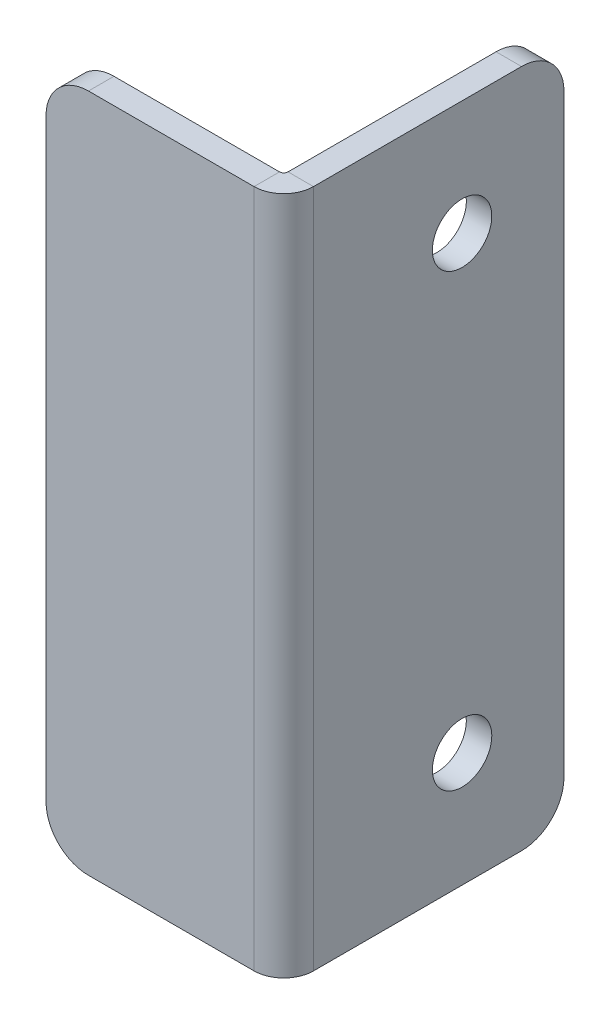
ISO-10303-21;
HEADER;
FILE_DESCRIPTION(('STEP AP214'),'2;1');
FILE_NAME('part.step','',(''),(''),'','','');
FILE_SCHEMA(('AUTOMOTIVE_DESIGN { 1 0 10303 214 1 1 1 1 }'));
ENDSEC;
DATA;
#1=APPLICATION_CONTEXT('core data for automotive mechanical design processes');
#2=APPLICATION_PROTOCOL_DEFINITION('international standard','automotive_design',2000,#1);
#3=PRODUCT_CONTEXT('',#1,'mechanical');
#4=PRODUCT('Part','Part','',(#3));
#5=PRODUCT_RELATED_PRODUCT_CATEGORY('part','',(#4));
#6=PRODUCT_DEFINITION_FORMATION('','',#4);
#7=PRODUCT_DEFINITION_CONTEXT('part definition',#1,'design');
#8=PRODUCT_DEFINITION('design','',#6,#7);
#9=PRODUCT_DEFINITION_SHAPE('','',#8);
#10=(LENGTH_UNIT() NAMED_UNIT(*) SI_UNIT(.MILLI.,.METRE.));
#11=(NAMED_UNIT(*) PLANE_ANGLE_UNIT() SI_UNIT($,.RADIAN.));
#12=(NAMED_UNIT(*) SI_UNIT($,.STERADIAN.) SOLID_ANGLE_UNIT());
#13=UNCERTAINTY_MEASURE_WITH_UNIT(LENGTH_MEASURE(1.E-05),#10,'distance_accuracy_value','');
#14=(GEOMETRIC_REPRESENTATION_CONTEXT(3) GLOBAL_UNCERTAINTY_ASSIGNED_CONTEXT((#13)) GLOBAL_UNIT_ASSIGNED_CONTEXT((#10,
#11,#12)) REPRESENTATION_CONTEXT('',''));
#15=CARTESIAN_POINT('',(0.,0.,0.));
#16=DIRECTION('',(0.,0.,1.));
#17=DIRECTION('',(1.,0.,0.));
#18=AXIS2_PLACEMENT_3D('',#15,#16,#17);
#19=CARTESIAN_POINT('',(0.,80.,29.5));
#20=DIRECTION('',(0.,1.,0.));
#21=DIRECTION('',(0.,0.,1.));
#22=AXIS2_PLACEMENT_3D('',#19,#20,#21);
#23=PLANE('',#22);
#24=DIRECTION('',(1.,0.,0.));
#25=VECTOR('',#24,1.);
#26=CARTESIAN_POINT('',(0.,80.,29.5));
#27=LINE('',#26,#25);
#28=CARTESIAN_POINT('',(0.,80.,29.5));
#29=VERTEX_POINT('',#28);
#30=CARTESIAN_POINT('',(3.,80.,29.5));
#31=VERTEX_POINT('',#30);
#32=EDGE_CURVE('E117',#29,#31,#27,.T.);
#33=ORIENTED_EDGE('',*,*,#32,.F.);
#34=CARTESIAN_POINT('',(-0.5,80.,29.5));
#35=DIRECTION('',(0.,1.,0.));
#36=DIRECTION('',(0.,0.,1.));
#37=AXIS2_PLACEMENT_3D('',#34,#35,#36);
#38=CIRCLE('',#37,0.5);
#39=CARTESIAN_POINT('',(-0.5,80.,30.));
#40=VERTEX_POINT('',#39);
#41=EDGE_CURVE('E112',#29,#40,#38,.F.);
#42=ORIENTED_EDGE('',*,*,#41,.T.);
#43=DIRECTION('',(0.,0.,-1.));
#44=VECTOR('',#43,1.);
#45=CARTESIAN_POINT('',(-0.5,80.,33.));
#46=LINE('',#45,#44);
#47=CARTESIAN_POINT('',(-0.5,80.,33.));
#48=VERTEX_POINT('',#47);
#49=EDGE_CURVE('E106',#48,#40,#46,.T.);
#50=ORIENTED_EDGE('',*,*,#49,.F.);
#51=CARTESIAN_POINT('',(-0.5,80.,29.5));
#52=DIRECTION('',(0.,1.,0.));
#53=DIRECTION('',(1.,0.,0.));
#54=AXIS2_PLACEMENT_3D('',#51,#52,#53);
#55=CIRCLE('',#54,3.5);
#56=EDGE_CURVE('E110',#31,#48,#55,.F.);
#57=ORIENTED_EDGE('',*,*,#56,.F.);
#58=EDGE_LOOP('',(#33,#42,#50,#57));
#59=FACE_BOUND('',#58,.T.);
#60=ADVANCED_FACE('F16',(#59),#23,.T.);
#61=CARTESIAN_POINT('',(-0.5,80.,33.));
#62=DIRECTION('',(0.,1.,0.));
#63=DIRECTION('',(0.,0.,1.));
#64=AXIS2_PLACEMENT_3D('',#61,#62,#63);
#65=PLANE('',#64);
#66=DIRECTION('',(0.,0.,1.));
#67=VECTOR('',#66,1.);
#68=CARTESIAN_POINT('',(3.,80.,0.));
#69=LINE('',#68,#67);
#70=CARTESIAN_POINT('',(3.,80.,5.));
#71=VERTEX_POINT('',#70);
#72=EDGE_CURVE('E144',#71,#31,#69,.T.);
#73=ORIENTED_EDGE('',*,*,#72,.F.);
#74=DIRECTION('',(1.,0.,0.));
#75=VECTOR('',#74,1.);
#76=CARTESIAN_POINT('',(-0.5,80.,5.));
#77=LINE('',#76,#75);
#78=CARTESIAN_POINT('',(0.,80.,5.));
#79=VERTEX_POINT('',#78);
#80=EDGE_CURVE('E11',#71,#79,#77,.F.);
#81=ORIENTED_EDGE('',*,*,#80,.T.);
#82=DIRECTION('',(0.,0.,1.));
#83=VECTOR('',#82,1.);
#84=CARTESIAN_POINT('',(0.,80.,0.));
#85=LINE('',#84,#83);
#86=EDGE_CURVE('E146',#79,#29,#85,.T.);
#87=ORIENTED_EDGE('',*,*,#86,.T.);
#88=ORIENTED_EDGE('',*,*,#32,.T.);
#89=EDGE_LOOP('',(#73,#81,#87,#88));
#90=FACE_BOUND('',#89,.T.);
#91=ADVANCED_FACE('F236',(#90),#65,.T.);
#92=CARTESIAN_POINT('',(-0.5,0.,30.));
#93=DIRECTION('',(0.,-1.,0.));
#94=DIRECTION('',(0.,0.,-1.));
#95=AXIS2_PLACEMENT_3D('',#92,#93,#94);
#96=PLANE('',#95);
#97=DIRECTION('',(0.,0.,1.));
#98=VECTOR('',#97,1.);
#99=CARTESIAN_POINT('',(-0.5,0.,30.));
#100=LINE('',#99,#98);
#101=CARTESIAN_POINT('',(-0.5,0.,30.));
#102=VERTEX_POINT('',#101);
#103=CARTESIAN_POINT('',(-0.5,0.,33.));
#104=VERTEX_POINT('',#103);
#105=EDGE_CURVE('E118',#102,#104,#100,.T.);
#106=ORIENTED_EDGE('',*,*,#105,.F.);
#107=CARTESIAN_POINT('',(-0.5,0.,29.5));
#108=DIRECTION('',(0.,1.,0.));
#109=DIRECTION('',(0.,0.,1.));
#110=AXIS2_PLACEMENT_3D('',#107,#108,#109);
#111=CIRCLE('',#110,0.5);
#112=CARTESIAN_POINT('',(0.,0.,29.5));
#113=VERTEX_POINT('',#112);
#114=EDGE_CURVE('E164',#113,#102,#111,.F.);
#115=ORIENTED_EDGE('',*,*,#114,.F.);
#116=DIRECTION('',(-1.,0.,0.));
#117=VECTOR('',#116,1.);
#118=CARTESIAN_POINT('',(3.,0.,29.5));
#119=LINE('',#118,#117);
#120=CARTESIAN_POINT('',(3.,0.,29.5));
#121=VERTEX_POINT('',#120);
#122=EDGE_CURVE('E182',#121,#113,#119,.T.);
#123=ORIENTED_EDGE('',*,*,#122,.F.);
#124=CARTESIAN_POINT('',(-0.5,0.,29.5));
#125=DIRECTION('',(0.,1.,0.));
#126=DIRECTION('',(1.,0.,0.));
#127=AXIS2_PLACEMENT_3D('',#124,#125,#126);
#128=CIRCLE('',#127,3.5);
#129=EDGE_CURVE('E158',#121,#104,#128,.F.);
#130=ORIENTED_EDGE('',*,*,#129,.T.);
#131=EDGE_LOOP('',(#106,#115,#123,#130));
#132=FACE_BOUND('',#131,.T.);
#133=ADVANCED_FACE('F290',(#132),#96,.T.);
#134=CARTESIAN_POINT('',(3.,0.,29.5));
#135=DIRECTION('',(0.,-1.,0.));
#136=DIRECTION('',(0.,0.,-1.));
#137=AXIS2_PLACEMENT_3D('',#134,#135,#136);
#138=PLANE('',#137);
#139=DIRECTION('',(1.,0.,0.));
#140=VECTOR('',#139,1.);
#141=CARTESIAN_POINT('',(0.,0.,33.));
#142=LINE('',#141,#140);
#143=CARTESIAN_POINT('',(-20.,0.,33.));
#144=VERTEX_POINT('',#143);
#145=EDGE_CURVE('E129',#104,#144,#142,.F.);
#146=ORIENTED_EDGE('',*,*,#145,.T.);
#147=DIRECTION('',(0.,0.,-1.));
#148=VECTOR('',#147,1.);
#149=CARTESIAN_POINT('',(-20.,0.,29.5));
#150=LINE('',#149,#148);
#151=CARTESIAN_POINT('',(-20.,0.,30.));
#152=VERTEX_POINT('',#151);
#153=EDGE_CURVE('E202',#144,#152,#150,.T.);
#154=ORIENTED_EDGE('',*,*,#153,.T.);
#155=DIRECTION('',(-1.,0.,0.));
#156=VECTOR('',#155,1.);
#157=CARTESIAN_POINT('',(0.,0.,30.));
#158=LINE('',#157,#156);
#159=EDGE_CURVE('E153',#102,#152,#158,.T.);
#160=ORIENTED_EDGE('',*,*,#159,.F.);
#161=ORIENTED_EDGE('',*,*,#105,.T.);
#162=EDGE_LOOP('',(#146,#154,#160,#161));
#163=FACE_BOUND('',#162,.T.);
#164=ADVANCED_FACE('F384',(#163),#138,.T.);
#165=CARTESIAN_POINT('',(0.,80.,30.));
#166=DIRECTION('',(0.,0.,1.));
#167=DIRECTION('',(1.,0.,0.));
#168=AXIS2_PLACEMENT_3D('',#165,#166,#167);
#169=PLANE('',#168);
#170=DIRECTION('',(0.,-1.,0.));
#171=VECTOR('',#170,1.);
#172=CARTESIAN_POINT('',(-25.,80.,30.));
#173=LINE('',#172,#171);
#174=CARTESIAN_POINT('',(-25.,75.,30.));
#175=VERTEX_POINT('',#174);
#176=CARTESIAN_POINT('',(-25.,5.,30.));
#177=VERTEX_POINT('',#176);
#178=EDGE_CURVE('E179',#175,#177,#173,.T.);
#179=ORIENTED_EDGE('',*,*,#178,.F.);
#180=CARTESIAN_POINT('',(-20.,75.,30.));
#181=DIRECTION('',(0.,0.,1.));
#182=DIRECTION('',(1.,0.,0.));
#183=AXIS2_PLACEMENT_3D('',#180,#181,#182);
#184=CIRCLE('',#183,5.);
#185=CARTESIAN_POINT('',(-20.,80.,30.));
#186=VERTEX_POINT('',#185);
#187=EDGE_CURVE('E195',#175,#186,#184,.F.);
#188=ORIENTED_EDGE('',*,*,#187,.T.);
#189=DIRECTION('',(-1.,0.,0.));
#190=VECTOR('',#189,1.);
#191=CARTESIAN_POINT('',(0.,80.,30.));
#192=LINE('',#191,#190);
#193=EDGE_CURVE('E139',#40,#186,#192,.T.);
#194=ORIENTED_EDGE('',*,*,#193,.F.);
#195=DIRECTION('',(0.,-1.,0.));
#196=VECTOR('',#195,1.);
#197=CARTESIAN_POINT('',(-0.5,80.,30.));
#198=LINE('',#197,#196);
#199=EDGE_CURVE('E152',#40,#102,#198,.T.);
#200=ORIENTED_EDGE('',*,*,#199,.T.);
#201=ORIENTED_EDGE('',*,*,#159,.T.);
#202=CARTESIAN_POINT('',(-20.,5.,30.));
#203=DIRECTION('',(0.,0.,1.));
#204=DIRECTION('',(1.,0.,0.));
#205=AXIS2_PLACEMENT_3D('',#202,#203,#204);
#206=CIRCLE('',#205,5.);
#207=EDGE_CURVE('E193',#152,#177,#206,.F.);
#208=ORIENTED_EDGE('',*,*,#207,.T.);
#209=EDGE_LOOP('',(#179,#188,#194,#200,#201,#208));
#210=FACE_BOUND('',#209,.T.);
#211=ADVANCED_FACE('F244',(#210),#169,.F.);
#212=CARTESIAN_POINT('',(-25.,80.,33.));
#213=DIRECTION('',(-1.,0.,0.));
#214=DIRECTION('',(0.,0.,1.));
#215=AXIS2_PLACEMENT_3D('',#212,#213,#214);
#216=PLANE('',#215);
#217=DIRECTION('',(0.,-1.,0.));
#218=VECTOR('',#217,1.);
#219=CARTESIAN_POINT('',(-25.,80.,33.));
#220=LINE('',#219,#218);
#221=CARTESIAN_POINT('',(-25.,75.,33.));
#222=VERTEX_POINT('',#221);
#223=CARTESIAN_POINT('',(-25.,5.,33.));
#224=VERTEX_POINT('',#223);
#225=EDGE_CURVE('E133',#222,#224,#220,.T.);
#226=ORIENTED_EDGE('',*,*,#225,.F.);
#227=DIRECTION('',(0.,0.,-1.));
#228=VECTOR('',#227,1.);
#229=CARTESIAN_POINT('',(-25.,75.,33.));
#230=LINE('',#229,#228);
#231=EDGE_CURVE('E190',#222,#175,#230,.T.);
#232=ORIENTED_EDGE('',*,*,#231,.T.);
#233=ORIENTED_EDGE('',*,*,#178,.T.);
#234=DIRECTION('',(0.,0.,-1.));
#235=VECTOR('',#234,1.);
#236=CARTESIAN_POINT('',(-25.,5.,33.));
#237=LINE('',#236,#235);
#238=EDGE_CURVE('E188',#177,#224,#237,.F.);
#239=ORIENTED_EDGE('',*,*,#238,.T.);
#240=EDGE_LOOP('',(#226,#232,#233,#239));
#241=FACE_BOUND('',#240,.T.);
#242=ADVANCED_FACE('F366',(#241),#216,.T.);
#243=CARTESIAN_POINT('',(0.,80.,33.));
#244=DIRECTION('',(0.,0.,1.));
#245=DIRECTION('',(1.,0.,0.));
#246=AXIS2_PLACEMENT_3D('',#243,#244,#245);
#247=PLANE('',#246);
#248=DIRECTION('',(1.,0.,0.));
#249=VECTOR('',#248,1.);
#250=CARTESIAN_POINT('',(0.,80.,33.));
#251=LINE('',#250,#249);
#252=CARTESIAN_POINT('',(-20.,80.,33.));
#253=VERTEX_POINT('',#252);
#254=EDGE_CURVE('E126',#48,#253,#251,.F.);
#255=ORIENTED_EDGE('',*,*,#254,.T.);
#256=CARTESIAN_POINT('',(-20.,75.,33.));
#257=DIRECTION('',(0.,0.,1.));
#258=DIRECTION('',(1.,0.,0.));
#259=AXIS2_PLACEMENT_3D('',#256,#257,#258);
#260=CIRCLE('',#259,5.);
#261=EDGE_CURVE('E200',#253,#222,#260,.T.);
#262=ORIENTED_EDGE('',*,*,#261,.T.);
#263=ORIENTED_EDGE('',*,*,#225,.T.);
#264=CARTESIAN_POINT('',(-20.,5.,33.));
#265=DIRECTION('',(0.,0.,1.));
#266=DIRECTION('',(1.,0.,0.));
#267=AXIS2_PLACEMENT_3D('',#264,#265,#266);
#268=CIRCLE('',#267,5.);
#269=EDGE_CURVE('E198',#224,#144,#268,.T.);
#270=ORIENTED_EDGE('',*,*,#269,.T.);
#271=ORIENTED_EDGE('',*,*,#145,.F.);
#272=DIRECTION('',(0.,-1.,0.));
#273=VECTOR('',#272,1.);
#274=CARTESIAN_POINT('',(-0.5,80.,33.));
#275=LINE('',#274,#273);
#276=EDGE_CURVE('E124',#48,#104,#275,.T.);
#277=ORIENTED_EDGE('',*,*,#276,.F.);
#278=EDGE_LOOP('',(#255,#262,#263,#270,#271,#277));
#279=FACE_BOUND('',#278,.T.);
#280=ADVANCED_FACE('F125',(#279),#247,.T.);
#281=CARTESIAN_POINT('',(-0.5,80.,29.5));
#282=DIRECTION('',(0.,-1.,0.));
#283=DIRECTION('',(0.,0.,-1.));
#284=AXIS2_PLACEMENT_3D('',#281,#282,#283);
#285=CYLINDRICAL_SURFACE('',#284,3.5);
#286=ORIENTED_EDGE('',*,*,#129,.F.);
#287=DIRECTION('',(0.,-1.,0.));
#288=VECTOR('',#287,1.);
#289=CARTESIAN_POINT('',(3.,80.,29.5));
#290=LINE('',#289,#288);
#291=EDGE_CURVE('E134',#31,#121,#290,.T.);
#292=ORIENTED_EDGE('',*,*,#291,.F.);
#293=ORIENTED_EDGE('',*,*,#56,.T.);
#294=ORIENTED_EDGE('',*,*,#276,.T.);
#295=EDGE_LOOP('',(#286,#292,#293,#294));
#296=FACE_BOUND('',#295,.T.);
#297=ADVANCED_FACE('F142',(#296),#285,.T.);
#298=CARTESIAN_POINT('',(3.,80.,0.));
#299=DIRECTION('',(1.,0.,0.));
#300=DIRECTION('',(0.,0.,-1.));
#301=AXIS2_PLACEMENT_3D('',#298,#299,#300);
#302=PLANE('',#301);
#303=CARTESIAN_POINT('',(3.,66.5,12.));
#304=DIRECTION('',(1.,0.,0.));
#305=DIRECTION('',(0.,0.,1.));
#306=AXIS2_PLACEMENT_3D('',#303,#304,#305);
#307=CIRCLE('',#306,3.5);
#308=CARTESIAN_POINT('',(3.,66.5,15.5));
#309=VERTEX_POINT('',#308);
#310=EDGE_CURVE('E252',#309,#309,#307,.T.);
#311=ORIENTED_EDGE('',*,*,#310,.F.);
#312=EDGE_LOOP('',(#311));
#313=FACE_BOUND('',#312,.T.);
#314=CARTESIAN_POINT('',(3.,13.5,12.));
#315=DIRECTION('',(1.,0.,0.));
#316=DIRECTION('',(0.,0.,-1.));
#317=AXIS2_PLACEMENT_3D('',#314,#315,#316);
#318=CIRCLE('',#317,3.5);
#319=CARTESIAN_POINT('',(3.,13.5,8.5));
#320=VERTEX_POINT('',#319);
#321=EDGE_CURVE('E246',#320,#320,#318,.T.);
#322=ORIENTED_EDGE('',*,*,#321,.F.);
#323=EDGE_LOOP('',(#322));
#324=FACE_BOUND('',#323,.T.);
#325=DIRECTION('',(0.,0.,1.));
#326=VECTOR('',#325,1.);
#327=CARTESIAN_POINT('',(3.,0.,0.));
#328=LINE('',#327,#326);
#329=CARTESIAN_POINT('',(3.,0.,5.));
#330=VERTEX_POINT('',#329);
#331=EDGE_CURVE('E160',#330,#121,#328,.T.);
#332=ORIENTED_EDGE('',*,*,#331,.F.);
#333=CARTESIAN_POINT('',(3.,5.,5.));
#334=DIRECTION('',(1.,0.,0.));
#335=DIRECTION('',(0.,0.,-1.));
#336=AXIS2_PLACEMENT_3D('',#333,#334,#335);
#337=CIRCLE('',#336,5.);
#338=CARTESIAN_POINT('',(3.,5.,0.));
#339=VERTEX_POINT('',#338);
#340=EDGE_CURVE('E210',#330,#339,#337,.T.);
#341=ORIENTED_EDGE('',*,*,#340,.T.);
#342=DIRECTION('',(0.,-1.,0.));
#343=VECTOR('',#342,1.);
#344=CARTESIAN_POINT('',(3.,80.,0.));
#345=LINE('',#344,#343);
#346=CARTESIAN_POINT('',(3.,75.,0.));
#347=VERTEX_POINT('',#346);
#348=EDGE_CURVE('E174',#347,#339,#345,.T.);
#349=ORIENTED_EDGE('',*,*,#348,.F.);
#350=CARTESIAN_POINT('',(3.,75.,5.));
#351=DIRECTION('',(1.,0.,0.));
#352=DIRECTION('',(0.,0.,-1.));
#353=AXIS2_PLACEMENT_3D('',#350,#351,#352);
#354=CIRCLE('',#353,5.);
#355=EDGE_CURVE('E208',#347,#71,#354,.T.);
#356=ORIENTED_EDGE('',*,*,#355,.T.);
#357=ORIENTED_EDGE('',*,*,#72,.T.);
#358=ORIENTED_EDGE('',*,*,#291,.T.);
#359=EDGE_LOOP('',(#332,#341,#349,#356,#357,#358));
#360=FACE_BOUND('',#359,.T.);
#361=ADVANCED_FACE('F231',(#313,#324,#360),#302,.T.);
#362=CARTESIAN_POINT('',(0.,80.,0.));
#363=DIRECTION('',(0.,0.,-1.));
#364=DIRECTION('',(-1.,0.,0.));
#365=AXIS2_PLACEMENT_3D('',#362,#363,#364);
#366=PLANE('',#365);
#367=ORIENTED_EDGE('',*,*,#348,.T.);
#368=DIRECTION('',(1.,0.,0.));
#369=VECTOR('',#368,1.);
#370=CARTESIAN_POINT('',(0.,5.,0.));
#371=LINE('',#370,#369);
#372=CARTESIAN_POINT('',(0.,5.,0.));
#373=VERTEX_POINT('',#372);
#374=EDGE_CURVE('E37',#339,#373,#371,.F.);
#375=ORIENTED_EDGE('',*,*,#374,.T.);
#376=DIRECTION('',(0.,-1.,0.));
#377=VECTOR('',#376,1.);
#378=CARTESIAN_POINT('',(0.,80.,0.));
#379=LINE('',#378,#377);
#380=CARTESIAN_POINT('',(0.,75.,0.));
#381=VERTEX_POINT('',#380);
#382=EDGE_CURVE('E172',#381,#373,#379,.T.);
#383=ORIENTED_EDGE('',*,*,#382,.F.);
#384=DIRECTION('',(1.,0.,0.));
#385=VECTOR('',#384,1.);
#386=CARTESIAN_POINT('',(0.,75.,0.));
#387=LINE('',#386,#385);
#388=EDGE_CURVE('E212',#381,#347,#387,.T.);
#389=ORIENTED_EDGE('',*,*,#388,.T.);
#390=EDGE_LOOP('',(#367,#375,#383,#389));
#391=FACE_BOUND('',#390,.T.);
#392=ADVANCED_FACE('F232',(#391),#366,.T.);
#393=CARTESIAN_POINT('',(0.,80.,0.));
#394=DIRECTION('',(1.,0.,0.));
#395=DIRECTION('',(0.,0.,-1.));
#396=AXIS2_PLACEMENT_3D('',#393,#394,#395);
#397=PLANE('',#396);
#398=CARTESIAN_POINT('',(0.,66.5,12.));
#399=DIRECTION('',(1.,0.,0.));
#400=DIRECTION('',(0.,0.,1.));
#401=AXIS2_PLACEMENT_3D('',#398,#399,#400);
#402=CIRCLE('',#401,3.5);
#403=CARTESIAN_POINT('',(0.,66.5,15.5));
#404=VERTEX_POINT('',#403);
#405=EDGE_CURVE('E249',#404,#404,#402,.T.);
#406=ORIENTED_EDGE('',*,*,#405,.T.);
#407=EDGE_LOOP('',(#406));
#408=FACE_BOUND('',#407,.T.);
#409=CARTESIAN_POINT('',(0.,13.5,12.));
#410=DIRECTION('',(1.,0.,0.));
#411=DIRECTION('',(0.,0.,-1.));
#412=AXIS2_PLACEMENT_3D('',#409,#410,#411);
#413=CIRCLE('',#412,3.5);
#414=CARTESIAN_POINT('',(0.,13.5,8.5));
#415=VERTEX_POINT('',#414);
#416=EDGE_CURVE('E156',#415,#415,#413,.T.);
#417=ORIENTED_EDGE('',*,*,#416,.T.);
#418=EDGE_LOOP('',(#417));
#419=FACE_BOUND('',#418,.T.);
#420=ORIENTED_EDGE('',*,*,#382,.T.);
#421=CARTESIAN_POINT('',(0.,5.,5.));
#422=DIRECTION('',(1.,0.,0.));
#423=DIRECTION('',(0.,0.,-1.));
#424=AXIS2_PLACEMENT_3D('',#421,#422,#423);
#425=CIRCLE('',#424,5.);
#426=CARTESIAN_POINT('',(0.,0.,5.));
#427=VERTEX_POINT('',#426);
#428=EDGE_CURVE('E24',#373,#427,#425,.F.);
#429=ORIENTED_EDGE('',*,*,#428,.T.);
#430=DIRECTION('',(0.,0.,1.));
#431=VECTOR('',#430,1.);
#432=CARTESIAN_POINT('',(0.,0.,0.));
#433=LINE('',#432,#431);
#434=EDGE_CURVE('E162',#427,#113,#433,.T.);
#435=ORIENTED_EDGE('',*,*,#434,.T.);
#436=DIRECTION('',(0.,-1.,0.));
#437=VECTOR('',#436,1.);
#438=CARTESIAN_POINT('',(0.,80.,29.5));
#439=LINE('',#438,#437);
#440=EDGE_CURVE('E169',#29,#113,#439,.T.);
#441=ORIENTED_EDGE('',*,*,#440,.F.);
#442=ORIENTED_EDGE('',*,*,#86,.F.);
#443=CARTESIAN_POINT('',(0.,75.,5.));
#444=DIRECTION('',(1.,0.,0.));
#445=DIRECTION('',(0.,0.,-1.));
#446=AXIS2_PLACEMENT_3D('',#443,#444,#445);
#447=CIRCLE('',#446,5.);
#448=EDGE_CURVE('E216',#79,#381,#447,.F.);
#449=ORIENTED_EDGE('',*,*,#448,.T.);
#450=EDGE_LOOP('',(#420,#429,#435,#441,#442,#449));
#451=FACE_BOUND('',#450,.T.);
#452=ADVANCED_FACE('F220',(#408,#419,#451),#397,.F.);
#453=CARTESIAN_POINT('',(-0.5,80.,29.5));
#454=DIRECTION('',(0.,-1.,0.));
#455=DIRECTION('',(0.,0.,-1.));
#456=AXIS2_PLACEMENT_3D('',#453,#454,#455);
#457=CYLINDRICAL_SURFACE('',#456,0.5);
#458=ORIENTED_EDGE('',*,*,#114,.T.);
#459=ORIENTED_EDGE('',*,*,#199,.F.);
#460=ORIENTED_EDGE('',*,*,#41,.F.);
#461=ORIENTED_EDGE('',*,*,#440,.T.);
#462=EDGE_LOOP('',(#458,#459,#460,#461));
#463=FACE_BOUND('',#462,.T.);
#464=ADVANCED_FACE('F239',(#463),#457,.F.);
#465=CARTESIAN_POINT('',(-0.5,80.,29.5));
#466=DIRECTION('',(0.,1.,0.));
#467=DIRECTION('',(1.,0.,0.));
#468=AXIS2_PLACEMENT_3D('',#465,#466,#467);
#469=PLANE('',#468);
#470=ORIENTED_EDGE('',*,*,#193,.T.);
#471=DIRECTION('',(0.,0.,-1.));
#472=VECTOR('',#471,1.);
#473=CARTESIAN_POINT('',(-20.,80.,29.5));
#474=LINE('',#473,#472);
#475=EDGE_CURVE('E138',#186,#253,#474,.F.);
#476=ORIENTED_EDGE('',*,*,#475,.T.);
#477=ORIENTED_EDGE('',*,*,#254,.F.);
#478=ORIENTED_EDGE('',*,*,#49,.T.);
#479=EDGE_LOOP('',(#470,#476,#477,#478));
#480=FACE_BOUND('',#479,.T.);
#481=ADVANCED_FACE('F136',(#480),#469,.T.);
#482=CARTESIAN_POINT('',(-0.5,0.,29.5));
#483=DIRECTION('',(0.,1.,0.));
#484=DIRECTION('',(1.,0.,0.));
#485=AXIS2_PLACEMENT_3D('',#482,#483,#484);
#486=PLANE('',#485);
#487=ORIENTED_EDGE('',*,*,#434,.F.);
#488=DIRECTION('',(1.,0.,0.));
#489=VECTOR('',#488,1.);
#490=CARTESIAN_POINT('',(3.,0.,5.));
#491=LINE('',#490,#489);
#492=EDGE_CURVE('E205',#427,#330,#491,.T.);
#493=ORIENTED_EDGE('',*,*,#492,.T.);
#494=ORIENTED_EDGE('',*,*,#331,.T.);
#495=ORIENTED_EDGE('',*,*,#122,.T.);
#496=EDGE_LOOP('',(#487,#493,#494,#495));
#497=FACE_BOUND('',#496,.T.);
#498=ADVANCED_FACE('F225',(#497),#486,.F.);
#499=CARTESIAN_POINT('',(0.,13.5,12.));
#500=DIRECTION('',(1.,0.,0.));
#501=DIRECTION('',(0.,0.,-1.));
#502=AXIS2_PLACEMENT_3D('',#499,#500,#501);
#503=CYLINDRICAL_SURFACE('',#502,3.5);
#504=ORIENTED_EDGE('',*,*,#416,.F.);
#505=EDGE_LOOP('',(#504));
#506=FACE_BOUND('',#505,.T.);
#507=ORIENTED_EDGE('',*,*,#321,.T.);
#508=EDGE_LOOP('',(#507));
#509=FACE_BOUND('',#508,.T.);
#510=ADVANCED_FACE('F264',(#506,#509),#503,.F.);
#511=CARTESIAN_POINT('',(0.,66.5,12.));
#512=DIRECTION('',(1.,0.,0.));
#513=DIRECTION('',(0.,0.,-1.));
#514=AXIS2_PLACEMENT_3D('',#511,#512,#513);
#515=CYLINDRICAL_SURFACE('',#514,3.5);
#516=ORIENTED_EDGE('',*,*,#405,.F.);
#517=EDGE_LOOP('',(#516));
#518=FACE_BOUND('',#517,.T.);
#519=ORIENTED_EDGE('',*,*,#310,.T.);
#520=EDGE_LOOP('',(#519));
#521=FACE_BOUND('',#520,.T.);
#522=ADVANCED_FACE('F260',(#518,#521),#515,.F.);
#523=CARTESIAN_POINT('',(-20.,75.,33.));
#524=DIRECTION('',(0.,0.,-1.));
#525=DIRECTION('',(-1.,0.,0.));
#526=AXIS2_PLACEMENT_3D('',#523,#524,#525);
#527=CYLINDRICAL_SURFACE('',#526,5.);
#528=ORIENTED_EDGE('',*,*,#261,.F.);
#529=ORIENTED_EDGE('',*,*,#475,.F.);
#530=ORIENTED_EDGE('',*,*,#187,.F.);
#531=ORIENTED_EDGE('',*,*,#231,.F.);
#532=EDGE_LOOP('',(#528,#529,#530,#531));
#533=FACE_BOUND('',#532,.T.);
#534=ADVANCED_FACE('F263',(#533),#527,.T.);
#535=CARTESIAN_POINT('',(-20.,5.,29.5));
#536=DIRECTION('',(0.,0.,-1.));
#537=DIRECTION('',(-1.,0.,0.));
#538=AXIS2_PLACEMENT_3D('',#535,#536,#537);
#539=CYLINDRICAL_SURFACE('',#538,5.);
#540=ORIENTED_EDGE('',*,*,#269,.F.);
#541=ORIENTED_EDGE('',*,*,#238,.F.);
#542=ORIENTED_EDGE('',*,*,#207,.F.);
#543=ORIENTED_EDGE('',*,*,#153,.F.);
#544=EDGE_LOOP('',(#540,#541,#542,#543));
#545=FACE_BOUND('',#544,.T.);
#546=ADVANCED_FACE('F296',(#545),#539,.T.);
#547=CARTESIAN_POINT('',(-0.5,5.,5.));
#548=DIRECTION('',(-1.,0.,0.));
#549=DIRECTION('',(0.,0.,1.));
#550=AXIS2_PLACEMENT_3D('',#547,#548,#549);
#551=CYLINDRICAL_SURFACE('',#550,5.);
#552=ORIENTED_EDGE('',*,*,#428,.F.);
#553=ORIENTED_EDGE('',*,*,#374,.F.);
#554=ORIENTED_EDGE('',*,*,#340,.F.);
#555=ORIENTED_EDGE('',*,*,#492,.F.);
#556=EDGE_LOOP('',(#552,#553,#554,#555));
#557=FACE_BOUND('',#556,.T.);
#558=ADVANCED_FACE('F228',(#557),#551,.T.);
#559=CARTESIAN_POINT('',(0.,75.,5.));
#560=DIRECTION('',(1.,0.,0.));
#561=DIRECTION('',(0.,0.,-1.));
#562=AXIS2_PLACEMENT_3D('',#559,#560,#561);
#563=CYLINDRICAL_SURFACE('',#562,5.);
#564=ORIENTED_EDGE('',*,*,#448,.F.);
#565=ORIENTED_EDGE('',*,*,#80,.F.);
#566=ORIENTED_EDGE('',*,*,#355,.F.);
#567=ORIENTED_EDGE('',*,*,#388,.F.);
#568=EDGE_LOOP('',(#564,#565,#566,#567));
#569=FACE_BOUND('',#568,.T.);
#570=ADVANCED_FACE('F18',(#569),#563,.T.);
#571=CLOSED_SHELL('',(#60,#91,#133,#164,#211,#242,#280,#297,#361,#392,#452,#464,#481,#498,#510,
#522,#534,#546,#558,#570));
#572=MANIFOLD_SOLID_BREP('B1',#571);
#573=ADVANCED_BREP_SHAPE_REPRESENTATION('',(#18,#572),#14);
#574=SHAPE_DEFINITION_REPRESENTATION(#9,#573);
ENDSEC;
END-ISO-10303-21;
